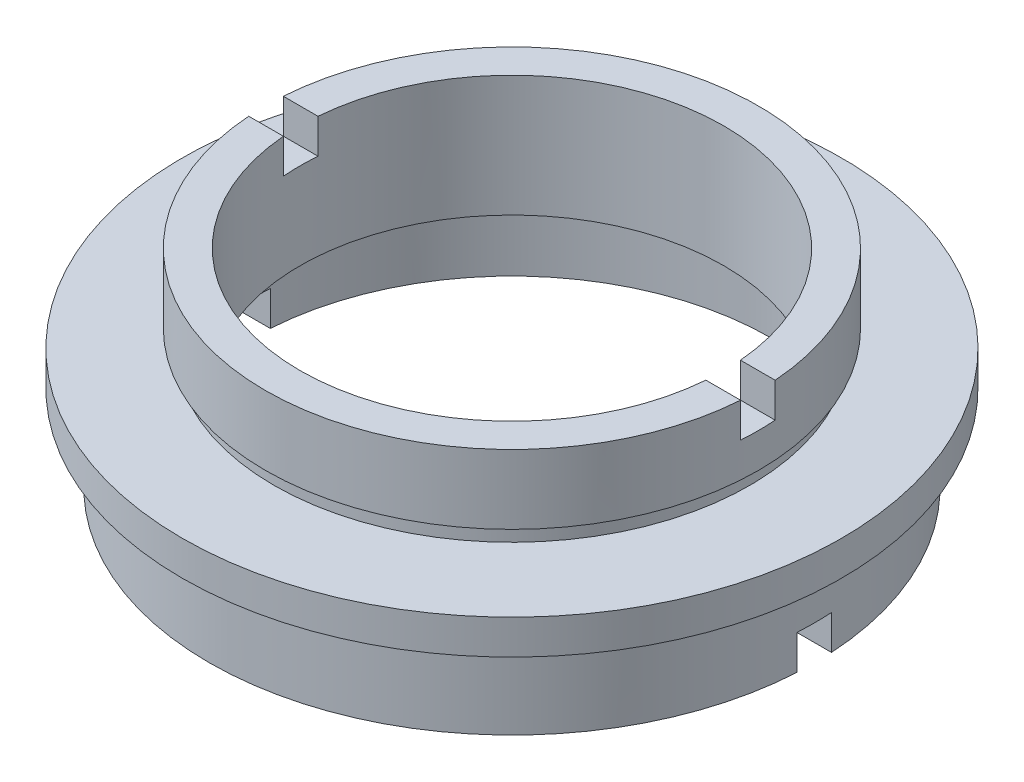
ISO-10303-21;
HEADER;
FILE_DESCRIPTION(('STEP AP214'),'2;1');
FILE_NAME('part.step','',(''),(''),'','','');
FILE_SCHEMA(('AUTOMOTIVE_DESIGN { 1 0 10303 214 1 1 1 1 }'));
ENDSEC;
DATA;
#1=APPLICATION_CONTEXT('core data for automotive mechanical design processes');
#2=APPLICATION_PROTOCOL_DEFINITION('international standard','automotive_design',2000,#1);
#3=PRODUCT_CONTEXT('',#1,'mechanical');
#4=PRODUCT('Part','Part','',(#3));
#5=PRODUCT_RELATED_PRODUCT_CATEGORY('part','',(#4));
#6=PRODUCT_DEFINITION_FORMATION('','',#4);
#7=PRODUCT_DEFINITION_CONTEXT('part definition',#1,'design');
#8=PRODUCT_DEFINITION('design','',#6,#7);
#9=PRODUCT_DEFINITION_SHAPE('','',#8);
#10=(LENGTH_UNIT() NAMED_UNIT(*) SI_UNIT(.MILLI.,.METRE.));
#11=(NAMED_UNIT(*) PLANE_ANGLE_UNIT() SI_UNIT($,.RADIAN.));
#12=(NAMED_UNIT(*) SI_UNIT($,.STERADIAN.) SOLID_ANGLE_UNIT());
#13=UNCERTAINTY_MEASURE_WITH_UNIT(LENGTH_MEASURE(1.E-05),#10,'distance_accuracy_value','');
#14=(GEOMETRIC_REPRESENTATION_CONTEXT(3) GLOBAL_UNCERTAINTY_ASSIGNED_CONTEXT((#13)) GLOBAL_UNIT_ASSIGNED_CONTEXT((#10,
#11,#12)) REPRESENTATION_CONTEXT('',''));
#15=CARTESIAN_POINT('',(0.,0.,0.));
#16=DIRECTION('',(0.,0.,1.));
#17=DIRECTION('',(1.,0.,0.));
#18=AXIS2_PLACEMENT_3D('',#15,#16,#17);
#19=CARTESIAN_POINT('',(-17.5,0.,0.));
#20=DIRECTION('',(0.,-1.,0.));
#21=DIRECTION('',(0.,0.,-1.));
#22=AXIS2_PLACEMENT_3D('',#19,#20,#21);
#23=PLANE('',#22);
#24=DIRECTION('',(-1.,0.,0.));
#25=VECTOR('',#24,1.);
#26=CARTESIAN_POINT('',(-17.5,0.,1.));
#27=LINE('',#26,#25);
#28=CARTESIAN_POINT('',(17.4714052096561,0.,1.));
#29=VERTEX_POINT('',#28);
#30=CARTESIAN_POINT('',(14.9666295470958,0.,1.));
#31=VERTEX_POINT('',#30);
#32=EDGE_CURVE('E183',#29,#31,#27,.T.);
#33=ORIENTED_EDGE('',*,*,#32,.F.);
#34=CARTESIAN_POINT('',(0.,0.,0.));
#35=DIRECTION('',(0.,1.,0.));
#36=DIRECTION('',(0.,0.,1.));
#37=AXIS2_PLACEMENT_3D('',#34,#35,#36);
#38=CIRCLE('',#37,17.5);
#39=CARTESIAN_POINT('',(-17.4714052096561,0.,1.));
#40=VERTEX_POINT('',#39);
#41=EDGE_CURVE('E238',#40,#29,#38,.T.);
#42=ORIENTED_EDGE('',*,*,#41,.F.);
#43=CARTESIAN_POINT('',(-14.9666295470958,0.,1.));
#44=VERTEX_POINT('',#43);
#45=EDGE_CURVE('E161',#44,#40,#27,.T.);
#46=ORIENTED_EDGE('',*,*,#45,.F.);
#47=CARTESIAN_POINT('',(0.,0.,0.));
#48=DIRECTION('',(0.,1.,0.));
#49=DIRECTION('',(0.,0.,1.));
#50=AXIS2_PLACEMENT_3D('',#47,#48,#49);
#51=CIRCLE('',#50,15.);
#52=EDGE_CURVE('E234',#44,#31,#51,.T.);
#53=ORIENTED_EDGE('',*,*,#52,.T.);
#54=EDGE_LOOP('',(#33,#42,#46,#53));
#55=FACE_BOUND('',#54,.T.);
#56=ADVANCED_FACE('F38',(#55),#23,.T.);
#57=CARTESIAN_POINT('',(-12.25,12.,0.));
#58=DIRECTION('',(0.,1.,0.));
#59=DIRECTION('',(0.,0.,1.));
#60=AXIS2_PLACEMENT_3D('',#57,#58,#59);
#61=PLANE('',#60);
#62=DIRECTION('',(1.,0.,0.));
#63=VECTOR('',#62,1.);
#64=CARTESIAN_POINT('',(-12.25,12.,1.));
#65=LINE('',#64,#63);
#66=CARTESIAN_POINT('',(-14.2148689758295,12.,1.));
#67=VERTEX_POINT('',#66);
#68=CARTESIAN_POINT('',(-12.2091154470748,12.,1.));
#69=VERTEX_POINT('',#68);
#70=EDGE_CURVE('E270',#67,#69,#65,.T.);
#71=ORIENTED_EDGE('',*,*,#70,.F.);
#72=CARTESIAN_POINT('',(0.,12.,0.));
#73=DIRECTION('',(0.,1.,0.));
#74=DIRECTION('',(0.,0.,1.));
#75=AXIS2_PLACEMENT_3D('',#72,#73,#74);
#76=CIRCLE('',#75,14.25);
#77=CARTESIAN_POINT('',(14.2148689758295,12.,1.));
#78=VERTEX_POINT('',#77);
#79=EDGE_CURVE('E214',#67,#78,#76,.T.);
#80=ORIENTED_EDGE('',*,*,#79,.T.);
#81=CARTESIAN_POINT('',(12.2091154470748,12.,1.));
#82=VERTEX_POINT('',#81);
#83=EDGE_CURVE('E268',#82,#78,#65,.T.);
#84=ORIENTED_EDGE('',*,*,#83,.F.);
#85=CARTESIAN_POINT('',(0.,12.,0.));
#86=DIRECTION('',(0.,1.,0.));
#87=DIRECTION('',(0.,0.,1.));
#88=AXIS2_PLACEMENT_3D('',#85,#86,#87);
#89=CIRCLE('',#88,12.25);
#90=EDGE_CURVE('E218',#69,#82,#89,.T.);
#91=ORIENTED_EDGE('',*,*,#90,.F.);
#92=EDGE_LOOP('',(#71,#80,#84,#91));
#93=FACE_BOUND('',#92,.T.);
#94=ADVANCED_FACE('F319',(#93),#61,.T.);
#95=CARTESIAN_POINT('',(0.,22.6774994510759,0.));
#96=DIRECTION('',(0.,1.,0.));
#97=DIRECTION('',(0.,0.,1.));
#98=AXIS2_PLACEMENT_3D('',#95,#96,#97);
#99=CYLINDRICAL_SURFACE('',#98,14.25);
#100=DIRECTION('',(0.,1.,0.));
#101=VECTOR('',#100,1.);
#102=CARTESIAN_POINT('',(-14.2148689758295,22.6774994510759,1.));
#103=LINE('',#102,#101);
#104=CARTESIAN_POINT('',(-14.2148689758295,10.,1.));
#105=VERTEX_POINT('',#104);
#106=EDGE_CURVE('E209',#105,#67,#103,.T.);
#107=ORIENTED_EDGE('',*,*,#106,.F.);
#108=CARTESIAN_POINT('',(0.,10.,0.));
#109=DIRECTION('',(0.,-1.,0.));
#110=DIRECTION('',(0.,0.,-1.));
#111=AXIS2_PLACEMENT_3D('',#108,#109,#110);
#112=CIRCLE('',#111,14.25);
#113=CARTESIAN_POINT('',(-14.2148689758295,10.,-0.999999999999997));
#114=VERTEX_POINT('',#113);
#115=EDGE_CURVE('E213',#114,#105,#112,.F.);
#116=ORIENTED_EDGE('',*,*,#115,.F.);
#117=DIRECTION('',(0.,1.,0.));
#118=VECTOR('',#117,1.);
#119=CARTESIAN_POINT('',(-14.2148689758295,22.6774994510759,-1.));
#120=LINE('',#119,#118);
#121=CARTESIAN_POINT('',(-14.2148689758295,12.,-0.999999999999998));
#122=VERTEX_POINT('',#121);
#123=EDGE_CURVE('E197',#122,#114,#120,.F.);
#124=ORIENTED_EDGE('',*,*,#123,.F.);
#125=CARTESIAN_POINT('',(14.2148689758295,12.,-0.999999999999998));
#126=VERTEX_POINT('',#125);
#127=EDGE_CURVE('E217',#126,#122,#76,.T.);
#128=ORIENTED_EDGE('',*,*,#127,.F.);
#129=DIRECTION('',(0.,1.,0.));
#130=VECTOR('',#129,1.);
#131=CARTESIAN_POINT('',(14.2148689758295,22.6774994510759,-1.));
#132=LINE('',#131,#130);
#133=CARTESIAN_POINT('',(14.2148689758295,10.,-0.999999999999997));
#134=VERTEX_POINT('',#133);
#135=EDGE_CURVE('E201',#134,#126,#132,.T.);
#136=ORIENTED_EDGE('',*,*,#135,.F.);
#137=CARTESIAN_POINT('',(14.2148689758295,10.,1.));
#138=VERTEX_POINT('',#137);
#139=EDGE_CURVE('E211',#138,#134,#112,.F.);
#140=ORIENTED_EDGE('',*,*,#139,.F.);
#141=DIRECTION('',(0.,1.,0.));
#142=VECTOR('',#141,1.);
#143=CARTESIAN_POINT('',(14.2148689758295,22.6774994510759,1.));
#144=LINE('',#143,#142);
#145=EDGE_CURVE('E205',#78,#138,#144,.F.);
#146=ORIENTED_EDGE('',*,*,#145,.F.);
#147=ORIENTED_EDGE('',*,*,#79,.F.);
#148=EDGE_LOOP('',(#107,#116,#124,#128,#136,#140,#146,#147));
#149=FACE_BOUND('',#148,.T.);
#150=CARTESIAN_POINT('',(0.,8.,0.));
#151=DIRECTION('',(0.,1.,0.));
#152=DIRECTION('',(0.,0.,1.));
#153=AXIS2_PLACEMENT_3D('',#150,#151,#152);
#154=CIRCLE('',#153,14.25);
#155=CARTESIAN_POINT('',(0.,8.,14.25));
#156=VERTEX_POINT('',#155);
#157=EDGE_CURVE('E262',#156,#156,#154,.T.);
#158=ORIENTED_EDGE('',*,*,#157,.T.);
#159=EDGE_LOOP('',(#158));
#160=FACE_BOUND('',#159,.T.);
#161=ADVANCED_FACE('F40',(#149,#160),#99,.T.);
#162=CARTESIAN_POINT('',(-14.25,8.,0.));
#163=DIRECTION('',(0.,-1.,0.));
#164=DIRECTION('',(0.,0.,-1.));
#165=AXIS2_PLACEMENT_3D('',#162,#163,#164);
#166=PLANE('',#165);
#167=CARTESIAN_POINT('',(0.,8.,0.));
#168=DIRECTION('',(0.,1.,0.));
#169=DIRECTION('',(0.,0.,1.));
#170=AXIS2_PLACEMENT_3D('',#167,#168,#169);
#171=CIRCLE('',#170,13.75);
#172=CARTESIAN_POINT('',(0.,8.,13.75));
#173=VERTEX_POINT('',#172);
#174=EDGE_CURVE('E259',#173,#173,#171,.T.);
#175=ORIENTED_EDGE('',*,*,#174,.T.);
#176=EDGE_LOOP('',(#175));
#177=FACE_BOUND('',#176,.T.);
#178=ORIENTED_EDGE('',*,*,#157,.F.);
#179=EDGE_LOOP('',(#178));
#180=FACE_BOUND('',#179,.T.);
#181=ADVANCED_FACE('F329',(#177,#180),#166,.T.);
#182=CARTESIAN_POINT('',(0.,22.6774994510759,0.));
#183=DIRECTION('',(0.,1.,0.));
#184=DIRECTION('',(0.,0.,1.));
#185=AXIS2_PLACEMENT_3D('',#182,#183,#184);
#186=CYLINDRICAL_SURFACE('',#185,13.75);
#187=CARTESIAN_POINT('',(0.,7.,0.));
#188=DIRECTION('',(0.,1.,0.));
#189=DIRECTION('',(0.,0.,1.));
#190=AXIS2_PLACEMENT_3D('',#187,#188,#189);
#191=CIRCLE('',#190,13.75);
#192=CARTESIAN_POINT('',(0.,7.,13.75));
#193=VERTEX_POINT('',#192);
#194=EDGE_CURVE('E256',#193,#193,#191,.T.);
#195=ORIENTED_EDGE('',*,*,#194,.T.);
#196=EDGE_LOOP('',(#195));
#197=FACE_BOUND('',#196,.T.);
#198=ORIENTED_EDGE('',*,*,#174,.F.);
#199=EDGE_LOOP('',(#198));
#200=FACE_BOUND('',#199,.T.);
#201=ADVANCED_FACE('F569',(#197,#200),#186,.T.);
#202=CARTESIAN_POINT('',(-13.75,7.,0.));
#203=DIRECTION('',(0.,1.,0.));
#204=DIRECTION('',(0.,0.,1.));
#205=AXIS2_PLACEMENT_3D('',#202,#203,#204);
#206=PLANE('',#205);
#207=CARTESIAN_POINT('',(0.,7.,0.));
#208=DIRECTION('',(0.,1.,0.));
#209=DIRECTION('',(0.,0.,1.));
#210=AXIS2_PLACEMENT_3D('',#207,#208,#209);
#211=CIRCLE('',#210,19.05);
#212=CARTESIAN_POINT('',(0.,7.,19.05));
#213=VERTEX_POINT('',#212);
#214=EDGE_CURVE('E253',#213,#213,#211,.T.);
#215=ORIENTED_EDGE('',*,*,#214,.T.);
#216=EDGE_LOOP('',(#215));
#217=FACE_BOUND('',#216,.T.);
#218=ORIENTED_EDGE('',*,*,#194,.F.);
#219=EDGE_LOOP('',(#218));
#220=FACE_BOUND('',#219,.T.);
#221=ADVANCED_FACE('F560',(#217,#220),#206,.T.);
#222=CARTESIAN_POINT('',(0.,22.6774994510759,0.));
#223=DIRECTION('',(0.,1.,0.));
#224=DIRECTION('',(0.,0.,1.));
#225=AXIS2_PLACEMENT_3D('',#222,#223,#224);
#226=CYLINDRICAL_SURFACE('',#225,19.05);
#227=CARTESIAN_POINT('',(0.,5.,0.));
#228=DIRECTION('',(0.,1.,0.));
#229=DIRECTION('',(0.,0.,1.));
#230=AXIS2_PLACEMENT_3D('',#227,#228,#229);
#231=CIRCLE('',#230,19.05);
#232=CARTESIAN_POINT('',(0.,5.,19.05));
#233=VERTEX_POINT('',#232);
#234=EDGE_CURVE('E250',#233,#233,#231,.T.);
#235=ORIENTED_EDGE('',*,*,#234,.T.);
#236=EDGE_LOOP('',(#235));
#237=FACE_BOUND('',#236,.T.);
#238=ORIENTED_EDGE('',*,*,#214,.F.);
#239=EDGE_LOOP('',(#238));
#240=FACE_BOUND('',#239,.T.);
#241=ADVANCED_FACE('F551',(#237,#240),#226,.T.);
#242=CARTESIAN_POINT('',(-19.05,5.,0.));
#243=DIRECTION('',(0.,-1.,0.));
#244=DIRECTION('',(0.,0.,-1.));
#245=AXIS2_PLACEMENT_3D('',#242,#243,#244);
#246=PLANE('',#245);
#247=CARTESIAN_POINT('',(0.,5.,0.));
#248=DIRECTION('',(0.,1.,0.));
#249=DIRECTION('',(0.,0.,1.));
#250=AXIS2_PLACEMENT_3D('',#247,#248,#249);
#251=CIRCLE('',#250,17.);
#252=CARTESIAN_POINT('',(0.,5.,17.));
#253=VERTEX_POINT('',#252);
#254=EDGE_CURVE('E247',#253,#253,#251,.T.);
#255=ORIENTED_EDGE('',*,*,#254,.T.);
#256=EDGE_LOOP('',(#255));
#257=FACE_BOUND('',#256,.T.);
#258=ORIENTED_EDGE('',*,*,#234,.F.);
#259=EDGE_LOOP('',(#258));
#260=FACE_BOUND('',#259,.T.);
#261=ADVANCED_FACE('F542',(#257,#260),#246,.T.);
#262=CARTESIAN_POINT('',(0.,22.6774994510759,0.));
#263=DIRECTION('',(0.,1.,0.));
#264=DIRECTION('',(0.,0.,1.));
#265=AXIS2_PLACEMENT_3D('',#262,#263,#264);
#266=CYLINDRICAL_SURFACE('',#265,17.);
#267=CARTESIAN_POINT('',(0.,4.,0.));
#268=DIRECTION('',(0.,1.,0.));
#269=DIRECTION('',(0.,0.,1.));
#270=AXIS2_PLACEMENT_3D('',#267,#268,#269);
#271=CIRCLE('',#270,17.);
#272=CARTESIAN_POINT('',(0.,4.,17.));
#273=VERTEX_POINT('',#272);
#274=EDGE_CURVE('E244',#273,#273,#271,.T.);
#275=ORIENTED_EDGE('',*,*,#274,.T.);
#276=EDGE_LOOP('',(#275));
#277=FACE_BOUND('',#276,.T.);
#278=ORIENTED_EDGE('',*,*,#254,.F.);
#279=EDGE_LOOP('',(#278));
#280=FACE_BOUND('',#279,.T.);
#281=ADVANCED_FACE('F533',(#277,#280),#266,.T.);
#282=CARTESIAN_POINT('',(-17.,4.,0.));
#283=DIRECTION('',(0.,1.,0.));
#284=DIRECTION('',(0.,0.,1.));
#285=AXIS2_PLACEMENT_3D('',#282,#283,#284);
#286=PLANE('',#285);
#287=CARTESIAN_POINT('',(0.,4.,0.));
#288=DIRECTION('',(0.,1.,0.));
#289=DIRECTION('',(0.,0.,1.));
#290=AXIS2_PLACEMENT_3D('',#287,#288,#289);
#291=CIRCLE('',#290,17.5);
#292=CARTESIAN_POINT('',(0.,4.,17.5));
#293=VERTEX_POINT('',#292);
#294=EDGE_CURVE('E241',#293,#293,#291,.T.);
#295=ORIENTED_EDGE('',*,*,#294,.T.);
#296=EDGE_LOOP('',(#295));
#297=FACE_BOUND('',#296,.T.);
#298=ORIENTED_EDGE('',*,*,#274,.F.);
#299=EDGE_LOOP('',(#298));
#300=FACE_BOUND('',#299,.T.);
#301=ADVANCED_FACE('F316',(#297,#300),#286,.T.);
#302=CARTESIAN_POINT('',(0.,22.6774994510759,0.));
#303=DIRECTION('',(0.,1.,0.));
#304=DIRECTION('',(0.,0.,1.));
#305=AXIS2_PLACEMENT_3D('',#302,#303,#304);
#306=CYLINDRICAL_SURFACE('',#305,17.5);
#307=DIRECTION('',(0.,1.,0.));
#308=VECTOR('',#307,1.);
#309=CARTESIAN_POINT('',(-17.4714052096561,22.6774994510759,1.));
#310=LINE('',#309,#308);
#311=CARTESIAN_POINT('',(-17.4714052096561,2.,1.));
#312=VERTEX_POINT('',#311);
#313=EDGE_CURVE('E182',#40,#312,#310,.T.);
#314=ORIENTED_EDGE('',*,*,#313,.F.);
#315=ORIENTED_EDGE('',*,*,#41,.T.);
#316=DIRECTION('',(0.,1.,0.));
#317=VECTOR('',#316,1.);
#318=CARTESIAN_POINT('',(17.4714052096561,22.6774994510759,1.));
#319=LINE('',#318,#317);
#320=CARTESIAN_POINT('',(17.4714052096561,2.,1.));
#321=VERTEX_POINT('',#320);
#322=EDGE_CURVE('E185',#321,#29,#319,.F.);
#323=ORIENTED_EDGE('',*,*,#322,.F.);
#324=CARTESIAN_POINT('',(0.,2.,0.));
#325=DIRECTION('',(0.,1.,0.));
#326=DIRECTION('',(0.,0.,1.));
#327=AXIS2_PLACEMENT_3D('',#324,#325,#326);
#328=CIRCLE('',#327,17.5);
#329=CARTESIAN_POINT('',(17.4714052096561,2.,-1.));
#330=VERTEX_POINT('',#329);
#331=EDGE_CURVE('E162',#330,#321,#328,.F.);
#332=ORIENTED_EDGE('',*,*,#331,.F.);
#333=DIRECTION('',(0.,1.,0.));
#334=VECTOR('',#333,1.);
#335=CARTESIAN_POINT('',(17.4714052096561,22.6774994510759,-0.999999999999994));
#336=LINE('',#335,#334);
#337=CARTESIAN_POINT('',(17.4714052096561,0.,-1.));
#338=VERTEX_POINT('',#337);
#339=EDGE_CURVE('E176',#338,#330,#336,.T.);
#340=ORIENTED_EDGE('',*,*,#339,.F.);
#341=CARTESIAN_POINT('',(-17.4714052096561,0.,-1.));
#342=VERTEX_POINT('',#341);
#343=EDGE_CURVE('E174',#338,#342,#38,.T.);
#344=ORIENTED_EDGE('',*,*,#343,.T.);
#345=DIRECTION('',(0.,1.,0.));
#346=VECTOR('',#345,1.);
#347=CARTESIAN_POINT('',(-17.4714052096561,22.6774994510759,-0.999999999999994));
#348=LINE('',#347,#346);
#349=CARTESIAN_POINT('',(-17.4714052096561,2.,-1.));
#350=VERTEX_POINT('',#349);
#351=EDGE_CURVE('E165',#350,#342,#348,.F.);
#352=ORIENTED_EDGE('',*,*,#351,.F.);
#353=EDGE_CURVE('E151',#312,#350,#328,.F.);
#354=ORIENTED_EDGE('',*,*,#353,.F.);
#355=EDGE_LOOP('',(#314,#315,#323,#332,#340,#344,#352,#354));
#356=FACE_BOUND('',#355,.T.);
#357=ORIENTED_EDGE('',*,*,#294,.F.);
#358=EDGE_LOOP('',(#357));
#359=FACE_BOUND('',#358,.T.);
#360=ADVANCED_FACE('F170',(#356,#359),#306,.T.);
#361=DIRECTION('',(1.,0.,0.));
#362=VECTOR('',#361,1.);
#363=CARTESIAN_POINT('',(-17.5,0.,-1.));
#364=LINE('',#363,#362);
#365=CARTESIAN_POINT('',(-14.9666295470958,0.,-0.999999999999995));
#366=VERTEX_POINT('',#365);
#367=EDGE_CURVE('E61',#342,#366,#364,.T.);
#368=ORIENTED_EDGE('',*,*,#367,.F.);
#369=ORIENTED_EDGE('',*,*,#343,.F.);
#370=CARTESIAN_POINT('',(14.9666295470958,0.,-0.999999999999994));
#371=VERTEX_POINT('',#370);
#372=EDGE_CURVE('E178',#371,#338,#364,.T.);
#373=ORIENTED_EDGE('',*,*,#372,.F.);
#374=EDGE_CURVE('E237',#371,#366,#51,.T.);
#375=ORIENTED_EDGE('',*,*,#374,.T.);
#376=EDGE_LOOP('',(#368,#369,#373,#375));
#377=FACE_BOUND('',#376,.T.);
#378=ADVANCED_FACE('F307',(#377),#23,.T.);
#379=CARTESIAN_POINT('',(0.,22.6774994510759,0.));
#380=DIRECTION('',(0.,1.,0.));
#381=DIRECTION('',(0.,0.,1.));
#382=AXIS2_PLACEMENT_3D('',#379,#380,#381);
#383=CYLINDRICAL_SURFACE('',#382,15.);
#384=DIRECTION('',(0.,1.,0.));
#385=VECTOR('',#384,1.);
#386=CARTESIAN_POINT('',(-14.9666295470958,22.6774994510759,1.));
#387=LINE('',#386,#385);
#388=CARTESIAN_POINT('',(-14.9666295470958,2.,1.));
#389=VERTEX_POINT('',#388);
#390=EDGE_CURVE('E12',#389,#44,#387,.F.);
#391=ORIENTED_EDGE('',*,*,#390,.F.);
#392=CARTESIAN_POINT('',(0.,2.,0.));
#393=DIRECTION('',(0.,1.,0.));
#394=DIRECTION('',(0.,0.,1.));
#395=AXIS2_PLACEMENT_3D('',#392,#393,#394);
#396=CIRCLE('',#395,15.);
#397=CARTESIAN_POINT('',(-14.9666295470958,2.,-1.));
#398=VERTEX_POINT('',#397);
#399=EDGE_CURVE('E46',#398,#389,#396,.T.);
#400=ORIENTED_EDGE('',*,*,#399,.F.);
#401=DIRECTION('',(0.,1.,0.));
#402=VECTOR('',#401,1.);
#403=CARTESIAN_POINT('',(-14.9666295470958,22.6774994510759,-0.999999999999994));
#404=LINE('',#403,#402);
#405=EDGE_CURVE('E166',#366,#398,#404,.T.);
#406=ORIENTED_EDGE('',*,*,#405,.F.);
#407=ORIENTED_EDGE('',*,*,#374,.F.);
#408=DIRECTION('',(0.,1.,0.));
#409=VECTOR('',#408,1.);
#410=CARTESIAN_POINT('',(14.9666295470958,22.6774994510759,-0.999999999999994));
#411=LINE('',#410,#409);
#412=CARTESIAN_POINT('',(14.9666295470958,2.,-0.999999999999994));
#413=VERTEX_POINT('',#412);
#414=EDGE_CURVE('E274',#413,#371,#411,.F.);
#415=ORIENTED_EDGE('',*,*,#414,.F.);
#416=CARTESIAN_POINT('',(14.9666295470958,2.,1.));
#417=VERTEX_POINT('',#416);
#418=EDGE_CURVE('E276',#417,#413,#396,.T.);
#419=ORIENTED_EDGE('',*,*,#418,.F.);
#420=DIRECTION('',(0.,1.,0.));
#421=VECTOR('',#420,1.);
#422=CARTESIAN_POINT('',(14.9666295470958,22.6774994510759,1.));
#423=LINE('',#422,#421);
#424=EDGE_CURVE('E278',#31,#417,#423,.T.);
#425=ORIENTED_EDGE('',*,*,#424,.F.);
#426=ORIENTED_EDGE('',*,*,#52,.F.);
#427=EDGE_LOOP('',(#391,#400,#406,#407,#415,#419,#425,#426));
#428=FACE_BOUND('',#427,.T.);
#429=CARTESIAN_POINT('',(0.,4.,0.));
#430=DIRECTION('',(0.,1.,0.));
#431=DIRECTION('',(0.,0.,1.));
#432=AXIS2_PLACEMENT_3D('',#429,#430,#431);
#433=CIRCLE('',#432,15.);
#434=CARTESIAN_POINT('',(0.,4.,15.));
#435=VERTEX_POINT('',#434);
#436=EDGE_CURVE('E231',#435,#435,#433,.T.);
#437=ORIENTED_EDGE('',*,*,#436,.T.);
#438=EDGE_LOOP('',(#437));
#439=FACE_BOUND('',#438,.T.);
#440=ADVANCED_FACE('F286',(#428,#439),#383,.F.);
#441=CARTESIAN_POINT('',(-15.6,4.,0.));
#442=DIRECTION('',(0.,1.,0.));
#443=DIRECTION('',(0.,0.,1.));
#444=AXIS2_PLACEMENT_3D('',#441,#442,#443);
#445=PLANE('',#444);
#446=CARTESIAN_POINT('',(0.,4.,0.));
#447=DIRECTION('',(0.,1.,0.));
#448=DIRECTION('',(0.,0.,1.));
#449=AXIS2_PLACEMENT_3D('',#446,#447,#448);
#450=CIRCLE('',#449,15.6);
#451=CARTESIAN_POINT('',(0.,4.,15.6));
#452=VERTEX_POINT('',#451);
#453=EDGE_CURVE('E228',#452,#452,#450,.T.);
#454=ORIENTED_EDGE('',*,*,#453,.T.);
#455=EDGE_LOOP('',(#454));
#456=FACE_BOUND('',#455,.T.);
#457=ORIENTED_EDGE('',*,*,#436,.F.);
#458=EDGE_LOOP('',(#457));
#459=FACE_BOUND('',#458,.T.);
#460=ADVANCED_FACE('F314',(#456,#459),#445,.T.);
#461=CARTESIAN_POINT('',(0.,22.6774994510759,0.));
#462=DIRECTION('',(0.,1.,0.));
#463=DIRECTION('',(0.,0.,1.));
#464=AXIS2_PLACEMENT_3D('',#461,#462,#463);
#465=CYLINDRICAL_SURFACE('',#464,15.6);
#466=CARTESIAN_POINT('',(0.,5.,0.));
#467=DIRECTION('',(0.,1.,0.));
#468=DIRECTION('',(0.,0.,1.));
#469=AXIS2_PLACEMENT_3D('',#466,#467,#468);
#470=CIRCLE('',#469,15.6);
#471=CARTESIAN_POINT('',(0.,5.,15.6));
#472=VERTEX_POINT('',#471);
#473=EDGE_CURVE('E225',#472,#472,#470,.T.);
#474=ORIENTED_EDGE('',*,*,#473,.T.);
#475=EDGE_LOOP('',(#474));
#476=FACE_BOUND('',#475,.T.);
#477=ORIENTED_EDGE('',*,*,#453,.F.);
#478=EDGE_LOOP('',(#477));
#479=FACE_BOUND('',#478,.T.);
#480=ADVANCED_FACE('F492',(#476,#479),#465,.F.);
#481=CARTESIAN_POINT('',(-12.25,5.,0.));
#482=DIRECTION('',(0.,-1.,0.));
#483=DIRECTION('',(0.,0.,-1.));
#484=AXIS2_PLACEMENT_3D('',#481,#482,#483);
#485=PLANE('',#484);
#486=CARTESIAN_POINT('',(0.,5.,0.));
#487=DIRECTION('',(0.,1.,0.));
#488=DIRECTION('',(0.,0.,1.));
#489=AXIS2_PLACEMENT_3D('',#486,#487,#488);
#490=CIRCLE('',#489,12.25);
#491=CARTESIAN_POINT('',(0.,5.,12.25));
#492=VERTEX_POINT('',#491);
#493=EDGE_CURVE('E222',#492,#492,#490,.T.);
#494=ORIENTED_EDGE('',*,*,#493,.T.);
#495=EDGE_LOOP('',(#494));
#496=FACE_BOUND('',#495,.T.);
#497=ORIENTED_EDGE('',*,*,#473,.F.);
#498=EDGE_LOOP('',(#497));
#499=FACE_BOUND('',#498,.T.);
#500=ADVANCED_FACE('F345',(#496,#499),#485,.T.);
#501=CARTESIAN_POINT('',(0.,22.6774994510759,0.));
#502=DIRECTION('',(0.,1.,0.));
#503=DIRECTION('',(0.,0.,1.));
#504=AXIS2_PLACEMENT_3D('',#501,#502,#503);
#505=CYLINDRICAL_SURFACE('',#504,12.25);
#506=DIRECTION('',(0.,1.,0.));
#507=VECTOR('',#506,1.);
#508=CARTESIAN_POINT('',(12.2091154470748,22.6774994510759,1.));
#509=LINE('',#508,#507);
#510=CARTESIAN_POINT('',(12.2091154470748,10.,1.));
#511=VERTEX_POINT('',#510);
#512=EDGE_CURVE('E203',#511,#82,#509,.T.);
#513=ORIENTED_EDGE('',*,*,#512,.F.);
#514=CARTESIAN_POINT('',(0.,10.,0.));
#515=DIRECTION('',(0.,-1.,0.));
#516=DIRECTION('',(0.,0.,-1.));
#517=AXIS2_PLACEMENT_3D('',#514,#515,#516);
#518=CIRCLE('',#517,12.25);
#519=CARTESIAN_POINT('',(12.2091154470748,10.,-0.999999999999997));
#520=VERTEX_POINT('',#519);
#521=EDGE_CURVE('E273',#520,#511,#518,.T.);
#522=ORIENTED_EDGE('',*,*,#521,.F.);
#523=DIRECTION('',(0.,1.,0.));
#524=VECTOR('',#523,1.);
#525=CARTESIAN_POINT('',(12.2091154470748,22.6774994510759,-1.));
#526=LINE('',#525,#524);
#527=CARTESIAN_POINT('',(12.2091154470748,12.,-0.999999999999998));
#528=VERTEX_POINT('',#527);
#529=EDGE_CURVE('E199',#528,#520,#526,.F.);
#530=ORIENTED_EDGE('',*,*,#529,.F.);
#531=CARTESIAN_POINT('',(-12.2091154470748,12.,-0.999999999999998));
#532=VERTEX_POINT('',#531);
#533=EDGE_CURVE('E221',#528,#532,#89,.T.);
#534=ORIENTED_EDGE('',*,*,#533,.T.);
#535=DIRECTION('',(0.,1.,0.));
#536=VECTOR('',#535,1.);
#537=CARTESIAN_POINT('',(-12.2091154470748,22.6774994510759,-1.));
#538=LINE('',#537,#536);
#539=CARTESIAN_POINT('',(-12.2091154470748,10.,-0.999999999999997));
#540=VERTEX_POINT('',#539);
#541=EDGE_CURVE('E195',#540,#532,#538,.T.);
#542=ORIENTED_EDGE('',*,*,#541,.F.);
#543=CARTESIAN_POINT('',(-12.2091154470748,10.,1.));
#544=VERTEX_POINT('',#543);
#545=EDGE_CURVE('E271',#544,#540,#518,.T.);
#546=ORIENTED_EDGE('',*,*,#545,.F.);
#547=DIRECTION('',(0.,1.,0.));
#548=VECTOR('',#547,1.);
#549=CARTESIAN_POINT('',(-12.2091154470748,22.6774994510759,1.));
#550=LINE('',#549,#548);
#551=EDGE_CURVE('E207',#69,#544,#550,.F.);
#552=ORIENTED_EDGE('',*,*,#551,.F.);
#553=ORIENTED_EDGE('',*,*,#90,.T.);
#554=EDGE_LOOP('',(#513,#522,#530,#534,#542,#546,#552,#553));
#555=FACE_BOUND('',#554,.T.);
#556=ORIENTED_EDGE('',*,*,#493,.F.);
#557=EDGE_LOOP('',(#556));
#558=FACE_BOUND('',#557,.T.);
#559=ADVANCED_FACE('F336',(#555,#558),#505,.F.);
#560=DIRECTION('',(-1.,0.,0.));
#561=VECTOR('',#560,1.);
#562=CARTESIAN_POINT('',(-12.25,12.,-0.999999999999998));
#563=LINE('',#562,#561);
#564=EDGE_CURVE('E267',#126,#528,#563,.T.);
#565=ORIENTED_EDGE('',*,*,#564,.F.);
#566=ORIENTED_EDGE('',*,*,#127,.T.);
#567=EDGE_CURVE('E265',#532,#122,#563,.T.);
#568=ORIENTED_EDGE('',*,*,#567,.F.);
#569=ORIENTED_EDGE('',*,*,#533,.F.);
#570=EDGE_LOOP('',(#565,#566,#568,#569));
#571=FACE_BOUND('',#570,.T.);
#572=ADVANCED_FACE('F325',(#571),#61,.T.);
#573=CARTESIAN_POINT('',(-39.5,13.5939878717808,1.));
#574=DIRECTION('',(0.,0.,1.));
#575=DIRECTION('',(0.,-1.,0.));
#576=AXIS2_PLACEMENT_3D('',#573,#574,#575);
#577=PLANE('',#576);
#578=ORIENTED_EDGE('',*,*,#106,.T.);
#579=ORIENTED_EDGE('',*,*,#70,.T.);
#580=ORIENTED_EDGE('',*,*,#551,.T.);
#581=DIRECTION('',(1.,0.,0.));
#582=VECTOR('',#581,1.);
#583=CARTESIAN_POINT('',(-39.5,10.,1.));
#584=LINE('',#583,#582);
#585=EDGE_CURVE('E192',#105,#544,#584,.T.);
#586=ORIENTED_EDGE('',*,*,#585,.F.);
#587=EDGE_LOOP('',(#578,#579,#580,#586));
#588=FACE_BOUND('',#587,.T.);
#589=ADVANCED_FACE('F335',(#588),#577,.F.);
#590=CARTESIAN_POINT('',(-39.5,13.5939878717808,-0.999999999999998));
#591=DIRECTION('',(0.,0.,-1.));
#592=DIRECTION('',(0.,1.,0.));
#593=AXIS2_PLACEMENT_3D('',#590,#591,#592);
#594=PLANE('',#593);
#595=ORIENTED_EDGE('',*,*,#123,.T.);
#596=DIRECTION('',(1.,0.,0.));
#597=VECTOR('',#596,1.);
#598=CARTESIAN_POINT('',(-39.5,10.,-0.999999999999997));
#599=LINE('',#598,#597);
#600=EDGE_CURVE('E191',#114,#540,#599,.T.);
#601=ORIENTED_EDGE('',*,*,#600,.T.);
#602=ORIENTED_EDGE('',*,*,#541,.T.);
#603=ORIENTED_EDGE('',*,*,#567,.T.);
#604=EDGE_LOOP('',(#595,#601,#602,#603));
#605=FACE_BOUND('',#604,.T.);
#606=ADVANCED_FACE('F342',(#605),#594,.F.);
#607=CARTESIAN_POINT('',(-39.5,10.,1.));
#608=DIRECTION('',(0.,-1.,0.));
#609=DIRECTION('',(0.,0.,-1.));
#610=AXIS2_PLACEMENT_3D('',#607,#608,#609);
#611=PLANE('',#610);
#612=ORIENTED_EDGE('',*,*,#115,.T.);
#613=ORIENTED_EDGE('',*,*,#585,.T.);
#614=ORIENTED_EDGE('',*,*,#545,.T.);
#615=ORIENTED_EDGE('',*,*,#600,.F.);
#616=EDGE_LOOP('',(#612,#613,#614,#615));
#617=FACE_BOUND('',#616,.T.);
#618=ADVANCED_FACE('F366',(#617),#611,.F.);
#619=ORIENTED_EDGE('',*,*,#139,.T.);
#620=EDGE_CURVE('E188',#520,#134,#599,.T.);
#621=ORIENTED_EDGE('',*,*,#620,.F.);
#622=ORIENTED_EDGE('',*,*,#521,.T.);
#623=EDGE_CURVE('E187',#511,#138,#584,.T.);
#624=ORIENTED_EDGE('',*,*,#623,.T.);
#625=EDGE_LOOP('',(#619,#621,#622,#624));
#626=FACE_BOUND('',#625,.T.);
#627=ADVANCED_FACE('F378',(#626),#611,.F.);
#628=ORIENTED_EDGE('',*,*,#135,.T.);
#629=ORIENTED_EDGE('',*,*,#564,.T.);
#630=ORIENTED_EDGE('',*,*,#529,.T.);
#631=ORIENTED_EDGE('',*,*,#620,.T.);
#632=EDGE_LOOP('',(#628,#629,#630,#631));
#633=FACE_BOUND('',#632,.T.);
#634=ADVANCED_FACE('F376',(#633),#594,.F.);
#635=ORIENTED_EDGE('',*,*,#145,.T.);
#636=ORIENTED_EDGE('',*,*,#623,.F.);
#637=ORIENTED_EDGE('',*,*,#512,.T.);
#638=ORIENTED_EDGE('',*,*,#83,.T.);
#639=EDGE_LOOP('',(#635,#636,#637,#638));
#640=FACE_BOUND('',#639,.T.);
#641=ADVANCED_FACE('F344',(#640),#577,.F.);
#642=CARTESIAN_POINT('',(-39.5,2.,-1.));
#643=DIRECTION('',(0.,0.,-1.));
#644=DIRECTION('',(0.,1.,0.));
#645=AXIS2_PLACEMENT_3D('',#642,#643,#644);
#646=PLANE('',#645);
#647=ORIENTED_EDGE('',*,*,#339,.T.);
#648=DIRECTION('',(1.,0.,0.));
#649=VECTOR('',#648,1.);
#650=CARTESIAN_POINT('',(-39.5,2.,-1.));
#651=LINE('',#650,#649);
#652=EDGE_CURVE('E53',#413,#330,#651,.T.);
#653=ORIENTED_EDGE('',*,*,#652,.F.);
#654=ORIENTED_EDGE('',*,*,#414,.T.);
#655=ORIENTED_EDGE('',*,*,#372,.T.);
#656=EDGE_LOOP('',(#647,#653,#654,#655));
#657=FACE_BOUND('',#656,.T.);
#658=ADVANCED_FACE('F301',(#657),#646,.F.);
#659=CARTESIAN_POINT('',(-39.5,2.,1.));
#660=DIRECTION('',(0.,1.,0.));
#661=DIRECTION('',(0.,0.,1.));
#662=AXIS2_PLACEMENT_3D('',#659,#660,#661);
#663=PLANE('',#662);
#664=ORIENTED_EDGE('',*,*,#331,.T.);
#665=DIRECTION('',(1.,0.,0.));
#666=VECTOR('',#665,1.);
#667=CARTESIAN_POINT('',(-39.5,2.,1.));
#668=LINE('',#667,#666);
#669=EDGE_CURVE('E167',#417,#321,#668,.T.);
#670=ORIENTED_EDGE('',*,*,#669,.F.);
#671=ORIENTED_EDGE('',*,*,#418,.T.);
#672=ORIENTED_EDGE('',*,*,#652,.T.);
#673=EDGE_LOOP('',(#664,#670,#671,#672));
#674=FACE_BOUND('',#673,.T.);
#675=ADVANCED_FACE('F302',(#674),#663,.F.);
#676=CARTESIAN_POINT('',(-39.5,2.,1.));
#677=DIRECTION('',(0.,0.,1.));
#678=DIRECTION('',(0.,-1.,0.));
#679=AXIS2_PLACEMENT_3D('',#676,#677,#678);
#680=PLANE('',#679);
#681=ORIENTED_EDGE('',*,*,#322,.T.);
#682=ORIENTED_EDGE('',*,*,#32,.T.);
#683=ORIENTED_EDGE('',*,*,#424,.T.);
#684=ORIENTED_EDGE('',*,*,#669,.T.);
#685=EDGE_LOOP('',(#681,#682,#683,#684));
#686=FACE_BOUND('',#685,.T.);
#687=ADVANCED_FACE('F297',(#686),#680,.F.);
#688=ORIENTED_EDGE('',*,*,#351,.T.);
#689=ORIENTED_EDGE('',*,*,#367,.T.);
#690=ORIENTED_EDGE('',*,*,#405,.T.);
#691=EDGE_CURVE('E154',#350,#398,#651,.T.);
#692=ORIENTED_EDGE('',*,*,#691,.F.);
#693=EDGE_LOOP('',(#688,#689,#690,#692));
#694=FACE_BOUND('',#693,.T.);
#695=ADVANCED_FACE('F164',(#694),#646,.F.);
#696=ORIENTED_EDGE('',*,*,#313,.T.);
#697=EDGE_CURVE('E157',#312,#389,#668,.T.);
#698=ORIENTED_EDGE('',*,*,#697,.T.);
#699=ORIENTED_EDGE('',*,*,#390,.T.);
#700=ORIENTED_EDGE('',*,*,#45,.T.);
#701=EDGE_LOOP('',(#696,#698,#699,#700));
#702=FACE_BOUND('',#701,.T.);
#703=ADVANCED_FACE('F282',(#702),#680,.F.);
#704=ORIENTED_EDGE('',*,*,#353,.T.);
#705=ORIENTED_EDGE('',*,*,#691,.T.);
#706=ORIENTED_EDGE('',*,*,#399,.T.);
#707=ORIENTED_EDGE('',*,*,#697,.F.);
#708=EDGE_LOOP('',(#704,#705,#706,#707));
#709=FACE_BOUND('',#708,.T.);
#710=ADVANCED_FACE('F153',(#709),#663,.F.);
#711=CLOSED_SHELL('',(#56,#94,#161,#181,#201,#221,#241,#261,#281,#301,#360,#378,#440,#460,#480,
#500,#559,#572,#589,#606,#618,#627,#634,#641,#658,#675,#687,#695,#703,#710));
#712=MANIFOLD_SOLID_BREP('B2',#711);
#713=ADVANCED_BREP_SHAPE_REPRESENTATION('',(#18,#712),#14);
#714=SHAPE_DEFINITION_REPRESENTATION(#9,#713);
ENDSEC;
END-ISO-10303-21;
